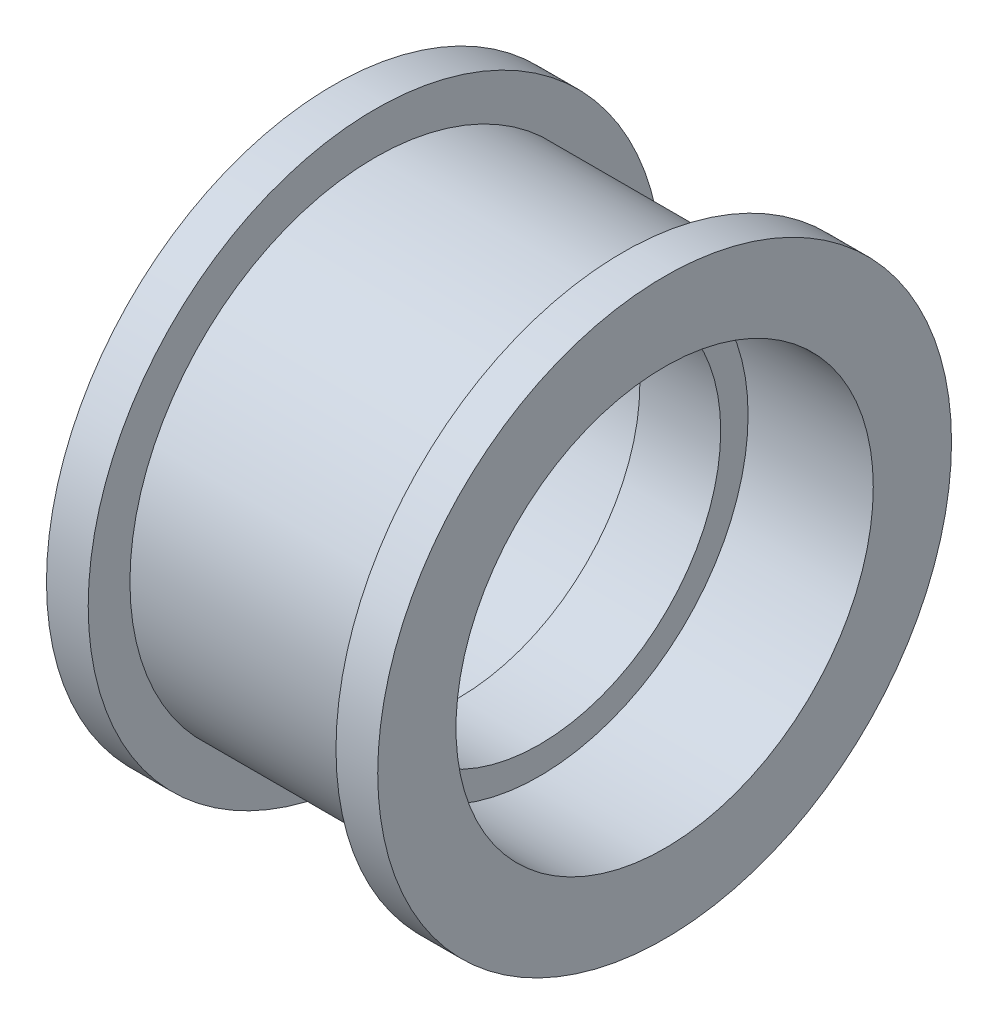
ISO-10303-21;
HEADER;
FILE_DESCRIPTION(('STEP AP214'),'2;1');
FILE_NAME('part.step','',(''),(''),'','','');
FILE_SCHEMA(('AUTOMOTIVE_DESIGN { 1 0 10303 214 1 1 1 1 }'));
ENDSEC;
DATA;
#1=APPLICATION_CONTEXT('core data for automotive mechanical design processes');
#2=APPLICATION_PROTOCOL_DEFINITION('international standard','automotive_design',2000,#1);
#3=PRODUCT_CONTEXT('',#1,'mechanical');
#4=PRODUCT('Part','Part','',(#3));
#5=PRODUCT_RELATED_PRODUCT_CATEGORY('part','',(#4));
#6=PRODUCT_DEFINITION_FORMATION('','',#4);
#7=PRODUCT_DEFINITION_CONTEXT('part definition',#1,'design');
#8=PRODUCT_DEFINITION('design','',#6,#7);
#9=PRODUCT_DEFINITION_SHAPE('','',#8);
#10=(LENGTH_UNIT() NAMED_UNIT(*) SI_UNIT(.MILLI.,.METRE.));
#11=(NAMED_UNIT(*) PLANE_ANGLE_UNIT() SI_UNIT($,.RADIAN.));
#12=(NAMED_UNIT(*) SI_UNIT($,.STERADIAN.) SOLID_ANGLE_UNIT());
#13=UNCERTAINTY_MEASURE_WITH_UNIT(LENGTH_MEASURE(1.E-05),#10,'distance_accuracy_value','');
#14=(GEOMETRIC_REPRESENTATION_CONTEXT(3) GLOBAL_UNCERTAINTY_ASSIGNED_CONTEXT((#13)) GLOBAL_UNIT_ASSIGNED_CONTEXT((#10,
#11,#12)) REPRESENTATION_CONTEXT('',''));
#15=CARTESIAN_POINT('',(0.,0.,0.));
#16=DIRECTION('',(0.,0.,1.));
#17=DIRECTION('',(1.,0.,0.));
#18=AXIS2_PLACEMENT_3D('',#15,#16,#17);
#19=CARTESIAN_POINT('',(-1.55,6.95,0.));
#20=DIRECTION('',(-1.,0.,0.));
#21=DIRECTION('',(0.,0.,1.));
#22=AXIS2_PLACEMENT_3D('',#19,#20,#21);
#23=PLANE('',#22);
#24=CARTESIAN_POINT('',(-1.55,0.,0.));
#25=DIRECTION('',(1.,0.,0.));
#26=DIRECTION('',(0.,0.,-1.));
#27=AXIS2_PLACEMENT_3D('',#24,#25,#26);
#28=CIRCLE('',#27,6.95);
#29=CARTESIAN_POINT('',(-1.55,0.,-6.95));
#30=VERTEX_POINT('',#29);
#31=EDGE_CURVE('E10',#30,#30,#28,.T.);
#32=ORIENTED_EDGE('',*,*,#31,.T.);
#33=EDGE_LOOP('',(#32));
#34=FACE_BOUND('',#33,.T.);
#35=CARTESIAN_POINT('',(-1.55,0.,0.));
#36=DIRECTION('',(1.,0.,0.));
#37=DIRECTION('',(0.,0.,-1.));
#38=AXIS2_PLACEMENT_3D('',#35,#36,#37);
#39=CIRCLE('',#38,8.);
#40=CARTESIAN_POINT('',(-1.55,0.,-8.));
#41=VERTEX_POINT('',#40);
#42=EDGE_CURVE('E71',#41,#41,#39,.T.);
#43=ORIENTED_EDGE('',*,*,#42,.F.);
#44=EDGE_LOOP('',(#43));
#45=FACE_BOUND('',#44,.T.);
#46=ADVANCED_FACE('F31',(#34,#45),#23,.T.);
#47=CARTESIAN_POINT('',(0.,0.,0.));
#48=DIRECTION('',(1.,0.,0.));
#49=DIRECTION('',(0.,0.,-1.));
#50=AXIS2_PLACEMENT_3D('',#47,#48,#49);
#51=CYLINDRICAL_SURFACE('',#50,6.95);
#52=CARTESIAN_POINT('',(1.55,0.,0.));
#53=DIRECTION('',(1.,0.,0.));
#54=DIRECTION('',(0.,0.,-1.));
#55=AXIS2_PLACEMENT_3D('',#52,#53,#54);
#56=CIRCLE('',#55,6.95);
#57=CARTESIAN_POINT('',(1.55,0.,-6.95));
#58=VERTEX_POINT('',#57);
#59=EDGE_CURVE('E37',#58,#58,#56,.T.);
#60=ORIENTED_EDGE('',*,*,#59,.T.);
#61=EDGE_LOOP('',(#60));
#62=FACE_BOUND('',#61,.T.);
#63=ORIENTED_EDGE('',*,*,#31,.F.);
#64=EDGE_LOOP('',(#63));
#65=FACE_BOUND('',#64,.T.);
#66=ADVANCED_FACE('F79',(#62,#65),#51,.F.);
#67=CARTESIAN_POINT('',(1.55,6.95,0.));
#68=DIRECTION('',(1.,0.,0.));
#69=DIRECTION('',(0.,0.,-1.));
#70=AXIS2_PLACEMENT_3D('',#67,#68,#69);
#71=PLANE('',#70);
#72=CARTESIAN_POINT('',(1.55,0.,0.));
#73=DIRECTION('',(1.,0.,0.));
#74=DIRECTION('',(0.,0.,-1.));
#75=AXIS2_PLACEMENT_3D('',#72,#73,#74);
#76=CIRCLE('',#75,8.);
#77=CARTESIAN_POINT('',(1.55,0.,-8.));
#78=VERTEX_POINT('',#77);
#79=EDGE_CURVE('E41',#78,#78,#76,.T.);
#80=ORIENTED_EDGE('',*,*,#79,.T.);
#81=EDGE_LOOP('',(#80));
#82=FACE_BOUND('',#81,.T.);
#83=ORIENTED_EDGE('',*,*,#59,.F.);
#84=EDGE_LOOP('',(#83));
#85=FACE_BOUND('',#84,.T.);
#86=ADVANCED_FACE('F83',(#82,#85),#71,.T.);
#87=CARTESIAN_POINT('',(0.,0.,0.));
#88=DIRECTION('',(1.,0.,0.));
#89=DIRECTION('',(0.,0.,-1.));
#90=AXIS2_PLACEMENT_3D('',#87,#88,#89);
#91=CYLINDRICAL_SURFACE('',#90,8.);
#92=CARTESIAN_POINT('',(6.35,0.,0.));
#93=DIRECTION('',(1.,0.,0.));
#94=DIRECTION('',(0.,0.,-1.));
#95=AXIS2_PLACEMENT_3D('',#92,#93,#94);
#96=CIRCLE('',#95,8.);
#97=CARTESIAN_POINT('',(6.35,0.,-8.));
#98=VERTEX_POINT('',#97);
#99=EDGE_CURVE('E45',#98,#98,#96,.T.);
#100=ORIENTED_EDGE('',*,*,#99,.T.);
#101=EDGE_LOOP('',(#100));
#102=FACE_BOUND('',#101,.T.);
#103=ORIENTED_EDGE('',*,*,#79,.F.);
#104=EDGE_LOOP('',(#103));
#105=FACE_BOUND('',#104,.T.);
#106=ADVANCED_FACE('F87',(#102,#105),#91,.F.);
#107=CARTESIAN_POINT('',(6.35,8.,0.));
#108=DIRECTION('',(1.,0.,0.));
#109=DIRECTION('',(0.,0.,-1.));
#110=AXIS2_PLACEMENT_3D('',#107,#108,#109);
#111=PLANE('',#110);
#112=CARTESIAN_POINT('',(6.35,0.,0.));
#113=DIRECTION('',(1.,0.,0.));
#114=DIRECTION('',(0.,0.,-1.));
#115=AXIS2_PLACEMENT_3D('',#112,#113,#114);
#116=CIRCLE('',#115,11.);
#117=CARTESIAN_POINT('',(6.35,0.,-11.));
#118=VERTEX_POINT('',#117);
#119=EDGE_CURVE('E50',#118,#118,#116,.T.);
#120=ORIENTED_EDGE('',*,*,#119,.T.);
#121=EDGE_LOOP('',(#120));
#122=FACE_BOUND('',#121,.T.);
#123=ORIENTED_EDGE('',*,*,#99,.F.);
#124=EDGE_LOOP('',(#123));
#125=FACE_BOUND('',#124,.T.);
#126=ADVANCED_FACE('F94',(#122,#125),#111,.T.);
#127=CARTESIAN_POINT('',(0.,0.,0.));
#128=DIRECTION('',(1.,0.,0.));
#129=DIRECTION('',(0.,0.,-1.));
#130=AXIS2_PLACEMENT_3D('',#127,#128,#129);
#131=CYLINDRICAL_SURFACE('',#130,11.);
#132=CARTESIAN_POINT('',(4.75,0.,0.));
#133=DIRECTION('',(1.,0.,0.));
#134=DIRECTION('',(0.,0.,-1.));
#135=AXIS2_PLACEMENT_3D('',#132,#133,#134);
#136=CIRCLE('',#135,11.);
#137=CARTESIAN_POINT('',(4.75,0.,-11.));
#138=VERTEX_POINT('',#137);
#139=EDGE_CURVE('E53',#138,#138,#136,.T.);
#140=ORIENTED_EDGE('',*,*,#139,.T.);
#141=EDGE_LOOP('',(#140));
#142=FACE_BOUND('',#141,.T.);
#143=ORIENTED_EDGE('',*,*,#119,.F.);
#144=EDGE_LOOP('',(#143));
#145=FACE_BOUND('',#144,.T.);
#146=ADVANCED_FACE('F98',(#142,#145),#131,.T.);
#147=CARTESIAN_POINT('',(4.75,11.,0.));
#148=DIRECTION('',(-1.,0.,0.));
#149=DIRECTION('',(0.,0.,1.));
#150=AXIS2_PLACEMENT_3D('',#147,#148,#149);
#151=PLANE('',#150);
#152=CARTESIAN_POINT('',(4.75,0.,0.));
#153=DIRECTION('',(1.,0.,0.));
#154=DIRECTION('',(0.,0.,-1.));
#155=AXIS2_PLACEMENT_3D('',#152,#153,#154);
#156=CIRCLE('',#155,9.4);
#157=CARTESIAN_POINT('',(4.75,0.,-9.4));
#158=VERTEX_POINT('',#157);
#159=EDGE_CURVE('E56',#158,#158,#156,.T.);
#160=ORIENTED_EDGE('',*,*,#159,.T.);
#161=EDGE_LOOP('',(#160));
#162=FACE_BOUND('',#161,.T.);
#163=ORIENTED_EDGE('',*,*,#139,.F.);
#164=EDGE_LOOP('',(#163));
#165=FACE_BOUND('',#164,.T.);
#166=ADVANCED_FACE('F102',(#162,#165),#151,.T.);
#167=CARTESIAN_POINT('',(0.,0.,0.));
#168=DIRECTION('',(1.,0.,0.));
#169=DIRECTION('',(0.,0.,-1.));
#170=AXIS2_PLACEMENT_3D('',#167,#168,#169);
#171=CYLINDRICAL_SURFACE('',#170,9.4);
#172=CARTESIAN_POINT('',(-4.75,0.,0.));
#173=DIRECTION('',(1.,0.,0.));
#174=DIRECTION('',(0.,0.,-1.));
#175=AXIS2_PLACEMENT_3D('',#172,#173,#174);
#176=CIRCLE('',#175,9.4);
#177=CARTESIAN_POINT('',(-4.75,0.,-9.4));
#178=VERTEX_POINT('',#177);
#179=EDGE_CURVE('E59',#178,#178,#176,.T.);
#180=ORIENTED_EDGE('',*,*,#179,.T.);
#181=EDGE_LOOP('',(#180));
#182=FACE_BOUND('',#181,.T.);
#183=ORIENTED_EDGE('',*,*,#159,.F.);
#184=EDGE_LOOP('',(#183));
#185=FACE_BOUND('',#184,.T.);
#186=ADVANCED_FACE('F106',(#182,#185),#171,.T.);
#187=CARTESIAN_POINT('',(-4.75,11.,0.));
#188=DIRECTION('',(1.,0.,0.));
#189=DIRECTION('',(0.,0.,-1.));
#190=AXIS2_PLACEMENT_3D('',#187,#188,#189);
#191=PLANE('',#190);
#192=CARTESIAN_POINT('',(-4.75,0.,0.));
#193=DIRECTION('',(1.,0.,0.));
#194=DIRECTION('',(0.,0.,-1.));
#195=AXIS2_PLACEMENT_3D('',#192,#193,#194);
#196=CIRCLE('',#195,11.);
#197=CARTESIAN_POINT('',(-4.75,0.,-11.));
#198=VERTEX_POINT('',#197);
#199=EDGE_CURVE('E62',#198,#198,#196,.T.);
#200=ORIENTED_EDGE('',*,*,#199,.T.);
#201=EDGE_LOOP('',(#200));
#202=FACE_BOUND('',#201,.T.);
#203=ORIENTED_EDGE('',*,*,#179,.F.);
#204=EDGE_LOOP('',(#203));
#205=FACE_BOUND('',#204,.T.);
#206=ADVANCED_FACE('F110',(#202,#205),#191,.T.);
#207=CARTESIAN_POINT('',(0.,0.,0.));
#208=DIRECTION('',(1.,0.,0.));
#209=DIRECTION('',(0.,0.,-1.));
#210=AXIS2_PLACEMENT_3D('',#207,#208,#209);
#211=CYLINDRICAL_SURFACE('',#210,11.);
#212=CARTESIAN_POINT('',(-6.35,0.,0.));
#213=DIRECTION('',(1.,0.,0.));
#214=DIRECTION('',(0.,0.,-1.));
#215=AXIS2_PLACEMENT_3D('',#212,#213,#214);
#216=CIRCLE('',#215,11.);
#217=CARTESIAN_POINT('',(-6.35,0.,-11.));
#218=VERTEX_POINT('',#217);
#219=EDGE_CURVE('E65',#218,#218,#216,.T.);
#220=ORIENTED_EDGE('',*,*,#219,.T.);
#221=EDGE_LOOP('',(#220));
#222=FACE_BOUND('',#221,.T.);
#223=ORIENTED_EDGE('',*,*,#199,.F.);
#224=EDGE_LOOP('',(#223));
#225=FACE_BOUND('',#224,.T.);
#226=ADVANCED_FACE('F114',(#222,#225),#211,.T.);
#227=CARTESIAN_POINT('',(-6.35,8.,0.));
#228=DIRECTION('',(-1.,0.,0.));
#229=DIRECTION('',(0.,0.,1.));
#230=AXIS2_PLACEMENT_3D('',#227,#228,#229);
#231=PLANE('',#230);
#232=CARTESIAN_POINT('',(-6.35,0.,0.));
#233=DIRECTION('',(1.,0.,0.));
#234=DIRECTION('',(0.,0.,-1.));
#235=AXIS2_PLACEMENT_3D('',#232,#233,#234);
#236=CIRCLE('',#235,8.);
#237=CARTESIAN_POINT('',(-6.35,0.,-8.));
#238=VERTEX_POINT('',#237);
#239=EDGE_CURVE('E68',#238,#238,#236,.T.);
#240=ORIENTED_EDGE('',*,*,#239,.T.);
#241=EDGE_LOOP('',(#240));
#242=FACE_BOUND('',#241,.T.);
#243=ORIENTED_EDGE('',*,*,#219,.F.);
#244=EDGE_LOOP('',(#243));
#245=FACE_BOUND('',#244,.T.);
#246=ADVANCED_FACE('F118',(#242,#245),#231,.T.);
#247=CARTESIAN_POINT('',(0.,0.,0.));
#248=DIRECTION('',(1.,0.,0.));
#249=DIRECTION('',(0.,0.,-1.));
#250=AXIS2_PLACEMENT_3D('',#247,#248,#249);
#251=CYLINDRICAL_SURFACE('',#250,8.);
#252=ORIENTED_EDGE('',*,*,#42,.T.);
#253=EDGE_LOOP('',(#252));
#254=FACE_BOUND('',#253,.T.);
#255=ORIENTED_EDGE('',*,*,#239,.F.);
#256=EDGE_LOOP('',(#255));
#257=FACE_BOUND('',#256,.T.);
#258=ADVANCED_FACE('F75',(#254,#257),#251,.F.);
#259=CLOSED_SHELL('',(#46,#66,#86,#106,#126,#146,#166,#186,#206,#226,#246,#258));
#260=MANIFOLD_SOLID_BREP('B2',#259);
#261=ADVANCED_BREP_SHAPE_REPRESENTATION('',(#18,#260),#14);
#262=SHAPE_DEFINITION_REPRESENTATION(#9,#261);
ENDSEC;
END-ISO-10303-21;
